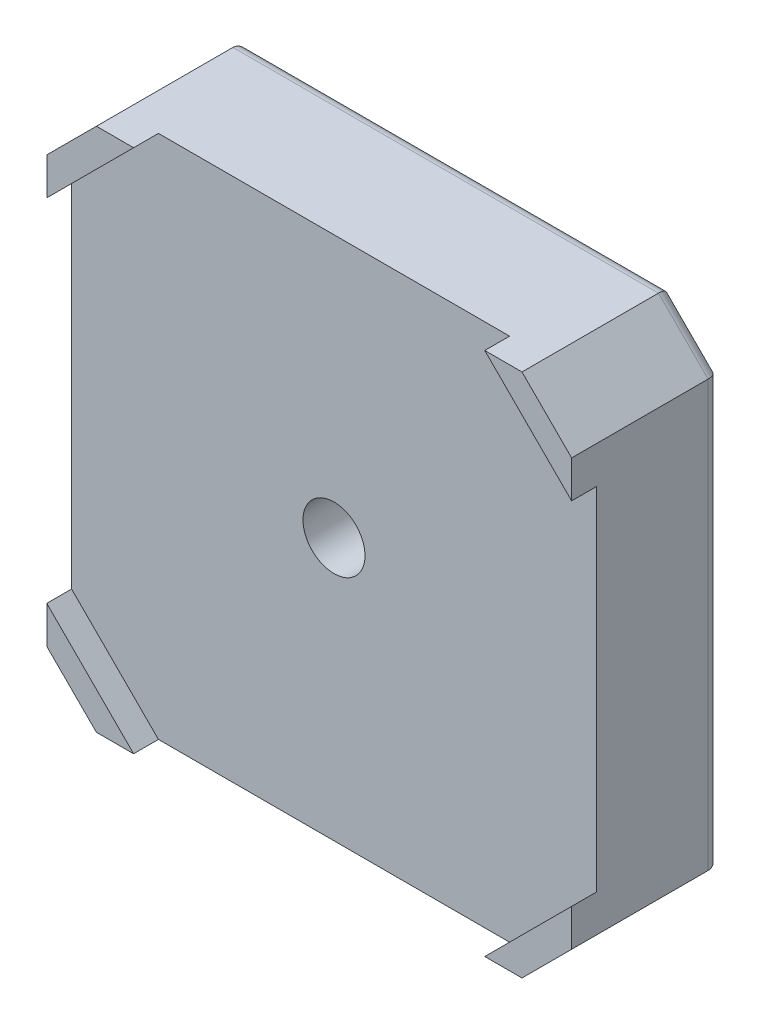
ISO-10303-21;
HEADER;
FILE_DESCRIPTION(('STEP AP214'),'2;1');
FILE_NAME('part.step','',(''),(''),'','','');
FILE_SCHEMA(('AUTOMOTIVE_DESIGN { 1 0 10303 214 1 1 1 1 }'));
ENDSEC;
DATA;
#1=APPLICATION_CONTEXT('core data for automotive mechanical design processes');
#2=APPLICATION_PROTOCOL_DEFINITION('international standard','automotive_design',2000,#1);
#3=PRODUCT_CONTEXT('',#1,'mechanical');
#4=PRODUCT('Part','Part','',(#3));
#5=PRODUCT_RELATED_PRODUCT_CATEGORY('part','',(#4));
#6=PRODUCT_DEFINITION_FORMATION('','',#4);
#7=PRODUCT_DEFINITION_CONTEXT('part definition',#1,'design');
#8=PRODUCT_DEFINITION('design','',#6,#7);
#9=PRODUCT_DEFINITION_SHAPE('','',#8);
#10=(LENGTH_UNIT() NAMED_UNIT(*) SI_UNIT(.MILLI.,.METRE.));
#11=(NAMED_UNIT(*) PLANE_ANGLE_UNIT() SI_UNIT($,.RADIAN.));
#12=(NAMED_UNIT(*) SI_UNIT($,.STERADIAN.) SOLID_ANGLE_UNIT());
#13=UNCERTAINTY_MEASURE_WITH_UNIT(LENGTH_MEASURE(1.E-05),#10,'distance_accuracy_value','');
#14=(GEOMETRIC_REPRESENTATION_CONTEXT(3) GLOBAL_UNCERTAINTY_ASSIGNED_CONTEXT((#13)) GLOBAL_UNIT_ASSIGNED_CONTEXT((#10,
#11,#12)) REPRESENTATION_CONTEXT('',''));
#15=CARTESIAN_POINT('',(0.,0.,0.));
#16=DIRECTION('',(0.,0.,1.));
#17=DIRECTION('',(1.,0.,0.));
#18=AXIS2_PLACEMENT_3D('',#15,#16,#17);
#19=CARTESIAN_POINT('',(0.,0.,24.));
#20=DIRECTION('',(0.,0.,-1.));
#21=DIRECTION('',(-1.,0.,0.));
#22=AXIS2_PLACEMENT_3D('',#19,#20,#21);
#23=PLANE('',#22);
#24=DIRECTION('',(0.,-1.,0.));
#25=VECTOR('',#24,1.);
#26=CARTESIAN_POINT('',(-42.3,-34.3,24.));
#27=LINE('',#26,#25);
#28=CARTESIAN_POINT('',(-42.3,34.3,24.));
#29=VERTEX_POINT('',#28);
#30=CARTESIAN_POINT('',(-42.3,28.3,24.));
#31=VERTEX_POINT('',#30);
#32=EDGE_CURVE('E208',#29,#31,#27,.T.);
#33=ORIENTED_EDGE('',*,*,#32,.T.);
#34=DIRECTION('',(-0.707106781186547,-0.707106781186547,0.));
#35=VECTOR('',#34,1.);
#36=CARTESIAN_POINT('',(-42.3,28.3,24.));
#37=LINE('',#36,#35);
#38=CARTESIAN_POINT('',(-28.3,42.3,24.));
#39=VERTEX_POINT('',#38);
#40=EDGE_CURVE('E194',#39,#31,#37,.T.);
#41=ORIENTED_EDGE('',*,*,#40,.F.);
#42=DIRECTION('',(-1.,0.,0.));
#43=VECTOR('',#42,1.);
#44=CARTESIAN_POINT('',(-34.3,42.3,24.));
#45=LINE('',#44,#43);
#46=CARTESIAN_POINT('',(-34.3,42.3,24.));
#47=VERTEX_POINT('',#46);
#48=EDGE_CURVE('E225',#39,#47,#45,.T.);
#49=ORIENTED_EDGE('',*,*,#48,.T.);
#50=DIRECTION('',(-0.707106781186548,-0.707106781186548,0.));
#51=VECTOR('',#50,1.);
#52=CARTESIAN_POINT('',(-42.3,34.3,24.));
#53=LINE('',#52,#51);
#54=EDGE_CURVE('E229',#47,#29,#53,.T.);
#55=ORIENTED_EDGE('',*,*,#54,.T.);
#56=EDGE_LOOP('',(#33,#41,#49,#55));
#57=FACE_BOUND('',#56,.T.);
#58=ADVANCED_FACE('F34',(#57),#23,.F.);
#59=CARTESIAN_POINT('',(34.3,42.3,24.));
#60=VERTEX_POINT('',#59);
#61=CARTESIAN_POINT('',(28.3,42.3,24.));
#62=VERTEX_POINT('',#61);
#63=EDGE_CURVE('E226',#60,#62,#45,.T.);
#64=ORIENTED_EDGE('',*,*,#63,.T.);
#65=DIRECTION('',(-0.707106781186547,0.707106781186548,0.));
#66=VECTOR('',#65,1.);
#67=CARTESIAN_POINT('',(28.3,42.3,24.));
#68=LINE('',#67,#66);
#69=CARTESIAN_POINT('',(42.3,28.3,24.));
#70=VERTEX_POINT('',#69);
#71=EDGE_CURVE('E426',#70,#62,#68,.T.);
#72=ORIENTED_EDGE('',*,*,#71,.F.);
#73=DIRECTION('',(0.,1.,0.));
#74=VECTOR('',#73,1.);
#75=CARTESIAN_POINT('',(42.3,-34.3,24.));
#76=LINE('',#75,#74);
#77=CARTESIAN_POINT('',(42.3,34.3,24.));
#78=VERTEX_POINT('',#77);
#79=EDGE_CURVE('E219',#70,#78,#76,.T.);
#80=ORIENTED_EDGE('',*,*,#79,.T.);
#81=DIRECTION('',(-0.707106781186548,0.707106781186548,0.));
#82=VECTOR('',#81,1.);
#83=CARTESIAN_POINT('',(34.3,42.3,24.));
#84=LINE('',#83,#82);
#85=EDGE_CURVE('E223',#78,#60,#84,.T.);
#86=ORIENTED_EDGE('',*,*,#85,.T.);
#87=EDGE_LOOP('',(#64,#72,#80,#86));
#88=FACE_BOUND('',#87,.T.);
#89=ADVANCED_FACE('F367',(#88),#23,.F.);
#90=CARTESIAN_POINT('',(42.3,-34.3,24.));
#91=VERTEX_POINT('',#90);
#92=CARTESIAN_POINT('',(42.3,-28.3,24.));
#93=VERTEX_POINT('',#92);
#94=EDGE_CURVE('E220',#91,#93,#76,.T.);
#95=ORIENTED_EDGE('',*,*,#94,.T.);
#96=DIRECTION('',(0.707106781186547,0.707106781186548,0.));
#97=VECTOR('',#96,1.);
#98=CARTESIAN_POINT('',(28.3,-42.3,24.));
#99=LINE('',#98,#97);
#100=CARTESIAN_POINT('',(28.3,-42.3,24.));
#101=VERTEX_POINT('',#100);
#102=EDGE_CURVE('E400',#101,#93,#99,.T.);
#103=ORIENTED_EDGE('',*,*,#102,.F.);
#104=DIRECTION('',(1.,0.,0.));
#105=VECTOR('',#104,1.);
#106=CARTESIAN_POINT('',(-34.3,-42.3,24.));
#107=LINE('',#106,#105);
#108=CARTESIAN_POINT('',(34.3,-42.3,24.));
#109=VERTEX_POINT('',#108);
#110=EDGE_CURVE('E213',#101,#109,#107,.T.);
#111=ORIENTED_EDGE('',*,*,#110,.T.);
#112=DIRECTION('',(0.707106781186547,0.707106781186548,0.));
#113=VECTOR('',#112,1.);
#114=CARTESIAN_POINT('',(34.3,-42.3,24.));
#115=LINE('',#114,#113);
#116=EDGE_CURVE('E217',#109,#91,#115,.T.);
#117=ORIENTED_EDGE('',*,*,#116,.T.);
#118=EDGE_LOOP('',(#95,#103,#111,#117));
#119=FACE_BOUND('',#118,.T.);
#120=ADVANCED_FACE('F374',(#119),#23,.F.);
#121=CARTESIAN_POINT('',(-42.3,-34.3,24.));
#122=DIRECTION('',(1.,0.,0.));
#123=DIRECTION('',(0.,0.,-1.));
#124=AXIS2_PLACEMENT_3D('',#121,#122,#123);
#125=PLANE('',#124);
#126=DIRECTION('',(0.,0.,-1.));
#127=VECTOR('',#126,1.);
#128=CARTESIAN_POINT('',(-42.3,34.3,24.));
#129=LINE('',#128,#127);
#130=CARTESIAN_POINT('',(-42.3,34.3,2.));
#131=VERTEX_POINT('',#130);
#132=EDGE_CURVE('E231',#29,#131,#129,.T.);
#133=ORIENTED_EDGE('',*,*,#132,.T.);
#134=DIRECTION('',(0.,-1.,0.));
#135=VECTOR('',#134,1.);
#136=CARTESIAN_POINT('',(-42.3,-34.3,2.));
#137=LINE('',#136,#135);
#138=CARTESIAN_POINT('',(-42.3,-34.3,2.));
#139=VERTEX_POINT('',#138);
#140=EDGE_CURVE('E277',#131,#139,#137,.T.);
#141=ORIENTED_EDGE('',*,*,#140,.T.);
#142=DIRECTION('',(0.,0.,-1.));
#143=VECTOR('',#142,1.);
#144=CARTESIAN_POINT('',(-42.3,-34.3,24.));
#145=LINE('',#144,#143);
#146=CARTESIAN_POINT('',(-42.3,-34.3,24.));
#147=VERTEX_POINT('',#146);
#148=EDGE_CURVE('E248',#147,#139,#145,.T.);
#149=ORIENTED_EDGE('',*,*,#148,.F.);
#150=CARTESIAN_POINT('',(-42.3,-28.3,24.));
#151=VERTEX_POINT('',#150);
#152=EDGE_CURVE('E200',#151,#147,#27,.T.);
#153=ORIENTED_EDGE('',*,*,#152,.F.);
#154=DIRECTION('',(0.,0.,1.));
#155=VECTOR('',#154,1.);
#156=CARTESIAN_POINT('',(-42.3,-28.3,20.));
#157=LINE('',#156,#155);
#158=CARTESIAN_POINT('',(-42.3,-28.3,20.));
#159=VERTEX_POINT('',#158);
#160=EDGE_CURVE('E177',#159,#151,#157,.T.);
#161=ORIENTED_EDGE('',*,*,#160,.F.);
#162=DIRECTION('',(0.,-1.,0.));
#163=VECTOR('',#162,1.);
#164=CARTESIAN_POINT('',(-42.3,-28.3,20.));
#165=LINE('',#164,#163);
#166=CARTESIAN_POINT('',(-42.3,28.3,20.));
#167=VERTEX_POINT('',#166);
#168=EDGE_CURVE('E185',#167,#159,#165,.T.);
#169=ORIENTED_EDGE('',*,*,#168,.F.);
#170=DIRECTION('',(0.,0.,1.));
#171=VECTOR('',#170,1.);
#172=CARTESIAN_POINT('',(-42.3,28.3,20.));
#173=LINE('',#172,#171);
#174=EDGE_CURVE('E423',#167,#31,#173,.T.);
#175=ORIENTED_EDGE('',*,*,#174,.T.);
#176=ORIENTED_EDGE('',*,*,#32,.F.);
#177=EDGE_LOOP('',(#133,#141,#149,#153,#161,#169,#175,#176));
#178=FACE_BOUND('',#177,.T.);
#179=ADVANCED_FACE('F198',(#178),#125,.F.);
#180=CARTESIAN_POINT('',(-42.3,-34.3,24.));
#181=DIRECTION('',(0.707106781186547,0.707106781186547,0.));
#182=DIRECTION('',(-0.707106781186548,0.707106781186548,0.));
#183=AXIS2_PLACEMENT_3D('',#180,#181,#182);
#184=PLANE('',#183);
#185=ORIENTED_EDGE('',*,*,#148,.T.);
#186=DIRECTION('',(0.707106781186548,-0.707106781186548,0.));
#187=VECTOR('',#186,1.);
#188=CARTESIAN_POINT('',(-34.3,-42.3,2.));
#189=LINE('',#188,#187);
#190=CARTESIAN_POINT('',(-34.3,-42.3,2.));
#191=VERTEX_POINT('',#190);
#192=EDGE_CURVE('E279',#139,#191,#189,.T.);
#193=ORIENTED_EDGE('',*,*,#192,.T.);
#194=DIRECTION('',(0.,0.,-1.));
#195=VECTOR('',#194,1.);
#196=CARTESIAN_POINT('',(-34.3,-42.3,24.));
#197=LINE('',#196,#195);
#198=CARTESIAN_POINT('',(-34.3,-42.3,24.));
#199=VERTEX_POINT('',#198);
#200=EDGE_CURVE('E245',#199,#191,#197,.T.);
#201=ORIENTED_EDGE('',*,*,#200,.F.);
#202=DIRECTION('',(0.707106781186548,-0.707106781186548,0.));
#203=VECTOR('',#202,1.);
#204=CARTESIAN_POINT('',(-42.3,-34.3,24.));
#205=LINE('',#204,#203);
#206=EDGE_CURVE('E211',#147,#199,#205,.T.);
#207=ORIENTED_EDGE('',*,*,#206,.F.);
#208=EDGE_LOOP('',(#185,#193,#201,#207));
#209=FACE_BOUND('',#208,.T.);
#210=ADVANCED_FACE('F396',(#209),#184,.F.);
#211=CARTESIAN_POINT('',(-34.3,-42.3,24.));
#212=DIRECTION('',(0.,1.,0.));
#213=DIRECTION('',(0.,0.,1.));
#214=AXIS2_PLACEMENT_3D('',#211,#212,#213);
#215=PLANE('',#214);
#216=ORIENTED_EDGE('',*,*,#200,.T.);
#217=DIRECTION('',(1.,0.,0.));
#218=VECTOR('',#217,1.);
#219=CARTESIAN_POINT('',(34.3,-42.3,2.));
#220=LINE('',#219,#218);
#221=CARTESIAN_POINT('',(34.3,-42.3,2.));
#222=VERTEX_POINT('',#221);
#223=EDGE_CURVE('E281',#191,#222,#220,.T.);
#224=ORIENTED_EDGE('',*,*,#223,.T.);
#225=DIRECTION('',(0.,0.,-1.));
#226=VECTOR('',#225,1.);
#227=CARTESIAN_POINT('',(34.3,-42.3,24.));
#228=LINE('',#227,#226);
#229=EDGE_CURVE('E242',#109,#222,#228,.T.);
#230=ORIENTED_EDGE('',*,*,#229,.F.);
#231=ORIENTED_EDGE('',*,*,#110,.F.);
#232=DIRECTION('',(0.,0.,1.));
#233=VECTOR('',#232,1.);
#234=CARTESIAN_POINT('',(28.3,-42.3,20.));
#235=LINE('',#234,#233);
#236=CARTESIAN_POINT('',(28.3,-42.3,20.));
#237=VERTEX_POINT('',#236);
#238=EDGE_CURVE('E202',#237,#101,#235,.T.);
#239=ORIENTED_EDGE('',*,*,#238,.F.);
#240=DIRECTION('',(1.,0.,0.));
#241=VECTOR('',#240,1.);
#242=CARTESIAN_POINT('',(-28.3,-42.3,20.));
#243=LINE('',#242,#241);
#244=CARTESIAN_POINT('',(-28.3,-42.3,20.));
#245=VERTEX_POINT('',#244);
#246=EDGE_CURVE('E184',#245,#237,#243,.T.);
#247=ORIENTED_EDGE('',*,*,#246,.F.);
#248=DIRECTION('',(0.,0.,1.));
#249=VECTOR('',#248,1.);
#250=CARTESIAN_POINT('',(-28.3,-42.3,20.));
#251=LINE('',#250,#249);
#252=CARTESIAN_POINT('',(-28.3,-42.3,24.));
#253=VERTEX_POINT('',#252);
#254=EDGE_CURVE('E180',#245,#253,#251,.T.);
#255=ORIENTED_EDGE('',*,*,#254,.T.);
#256=EDGE_CURVE('E214',#199,#253,#107,.T.);
#257=ORIENTED_EDGE('',*,*,#256,.F.);
#258=EDGE_LOOP('',(#216,#224,#230,#231,#239,#247,#255,#257));
#259=FACE_BOUND('',#258,.T.);
#260=ADVANCED_FACE('F783',(#259),#215,.F.);
#261=CARTESIAN_POINT('',(34.3,-42.3,24.));
#262=DIRECTION('',(-0.707106781186548,0.707106781186547,0.));
#263=DIRECTION('',(-0.707106781186547,-0.707106781186548,0.));
#264=AXIS2_PLACEMENT_3D('',#261,#262,#263);
#265=PLANE('',#264);
#266=ORIENTED_EDGE('',*,*,#229,.T.);
#267=DIRECTION('',(0.707106781186547,0.707106781186548,0.));
#268=VECTOR('',#267,1.);
#269=CARTESIAN_POINT('',(42.3,-34.3,2.));
#270=LINE('',#269,#268);
#271=CARTESIAN_POINT('',(42.3,-34.3,2.));
#272=VERTEX_POINT('',#271);
#273=EDGE_CURVE('E283',#222,#272,#270,.T.);
#274=ORIENTED_EDGE('',*,*,#273,.T.);
#275=DIRECTION('',(0.,0.,-1.));
#276=VECTOR('',#275,1.);
#277=CARTESIAN_POINT('',(42.3,-34.3,24.));
#278=LINE('',#277,#276);
#279=EDGE_CURVE('E240',#91,#272,#278,.T.);
#280=ORIENTED_EDGE('',*,*,#279,.F.);
#281=ORIENTED_EDGE('',*,*,#116,.F.);
#282=EDGE_LOOP('',(#266,#274,#280,#281));
#283=FACE_BOUND('',#282,.T.);
#284=ADVANCED_FACE('F775',(#283),#265,.F.);
#285=CARTESIAN_POINT('',(42.3,-34.3,24.));
#286=DIRECTION('',(-1.,0.,0.));
#287=DIRECTION('',(0.,0.,1.));
#288=AXIS2_PLACEMENT_3D('',#285,#286,#287);
#289=PLANE('',#288);
#290=ORIENTED_EDGE('',*,*,#279,.T.);
#291=DIRECTION('',(0.,1.,0.));
#292=VECTOR('',#291,1.);
#293=CARTESIAN_POINT('',(42.3,34.3,2.));
#294=LINE('',#293,#292);
#295=CARTESIAN_POINT('',(42.3,34.3,2.));
#296=VERTEX_POINT('',#295);
#297=EDGE_CURVE('E57',#272,#296,#294,.T.);
#298=ORIENTED_EDGE('',*,*,#297,.T.);
#299=DIRECTION('',(0.,0.,-1.));
#300=VECTOR('',#299,1.);
#301=CARTESIAN_POINT('',(42.3,34.3,24.));
#302=LINE('',#301,#300);
#303=EDGE_CURVE('E238',#78,#296,#302,.T.);
#304=ORIENTED_EDGE('',*,*,#303,.F.);
#305=ORIENTED_EDGE('',*,*,#79,.F.);
#306=DIRECTION('',(0.,0.,1.));
#307=VECTOR('',#306,1.);
#308=CARTESIAN_POINT('',(42.3,28.3,20.));
#309=LINE('',#308,#307);
#310=CARTESIAN_POINT('',(42.3,28.3,20.));
#311=VERTEX_POINT('',#310);
#312=EDGE_CURVE('E414',#311,#70,#309,.T.);
#313=ORIENTED_EDGE('',*,*,#312,.F.);
#314=DIRECTION('',(0.,1.,0.));
#315=VECTOR('',#314,1.);
#316=CARTESIAN_POINT('',(42.3,-28.3,20.));
#317=LINE('',#316,#315);
#318=CARTESIAN_POINT('',(42.3,-28.3,20.));
#319=VERTEX_POINT('',#318);
#320=EDGE_CURVE('E411',#319,#311,#317,.T.);
#321=ORIENTED_EDGE('',*,*,#320,.F.);
#322=DIRECTION('',(0.,0.,1.));
#323=VECTOR('',#322,1.);
#324=CARTESIAN_POINT('',(42.3,-28.3,20.));
#325=LINE('',#324,#323);
#326=EDGE_CURVE('E408',#319,#93,#325,.T.);
#327=ORIENTED_EDGE('',*,*,#326,.T.);
#328=ORIENTED_EDGE('',*,*,#94,.F.);
#329=EDGE_LOOP('',(#290,#298,#304,#305,#313,#321,#327,#328));
#330=FACE_BOUND('',#329,.T.);
#331=ADVANCED_FACE('F405',(#330),#289,.F.);
#332=CARTESIAN_POINT('',(34.3,42.3,24.));
#333=DIRECTION('',(-0.707106781186547,-0.707106781186547,0.));
#334=DIRECTION('',(0.707106781186548,-0.707106781186548,0.));
#335=AXIS2_PLACEMENT_3D('',#332,#333,#334);
#336=PLANE('',#335);
#337=ORIENTED_EDGE('',*,*,#303,.T.);
#338=DIRECTION('',(-0.707106781186548,0.707106781186548,0.));
#339=VECTOR('',#338,1.);
#340=CARTESIAN_POINT('',(34.3,42.3,2.));
#341=LINE('',#340,#339);
#342=CARTESIAN_POINT('',(34.3,42.3,2.));
#343=VERTEX_POINT('',#342);
#344=EDGE_CURVE('E49',#296,#343,#341,.T.);
#345=ORIENTED_EDGE('',*,*,#344,.T.);
#346=DIRECTION('',(0.,0.,-1.));
#347=VECTOR('',#346,1.);
#348=CARTESIAN_POINT('',(34.3,42.3,24.));
#349=LINE('',#348,#347);
#350=EDGE_CURVE('E236',#60,#343,#349,.T.);
#351=ORIENTED_EDGE('',*,*,#350,.F.);
#352=ORIENTED_EDGE('',*,*,#85,.F.);
#353=EDGE_LOOP('',(#337,#345,#351,#352));
#354=FACE_BOUND('',#353,.T.);
#355=ADVANCED_FACE('F759',(#354),#336,.F.);
#356=CARTESIAN_POINT('',(-34.3,42.3,24.));
#357=DIRECTION('',(0.,-1.,0.));
#358=DIRECTION('',(0.,0.,-1.));
#359=AXIS2_PLACEMENT_3D('',#356,#357,#358);
#360=PLANE('',#359);
#361=ORIENTED_EDGE('',*,*,#350,.T.);
#362=DIRECTION('',(-1.,0.,0.));
#363=VECTOR('',#362,1.);
#364=CARTESIAN_POINT('',(-34.3,42.3,2.));
#365=LINE('',#364,#363);
#366=CARTESIAN_POINT('',(-34.3,42.3,2.));
#367=VERTEX_POINT('',#366);
#368=EDGE_CURVE('E287',#343,#367,#365,.T.);
#369=ORIENTED_EDGE('',*,*,#368,.T.);
#370=DIRECTION('',(0.,0.,-1.));
#371=VECTOR('',#370,1.);
#372=CARTESIAN_POINT('',(-34.3,42.3,24.));
#373=LINE('',#372,#371);
#374=EDGE_CURVE('E233',#47,#367,#373,.T.);
#375=ORIENTED_EDGE('',*,*,#374,.F.);
#376=ORIENTED_EDGE('',*,*,#48,.F.);
#377=DIRECTION('',(0.,0.,1.));
#378=VECTOR('',#377,1.);
#379=CARTESIAN_POINT('',(-28.3,42.3,20.));
#380=LINE('',#379,#378);
#381=CARTESIAN_POINT('',(-28.3,42.3,20.));
#382=VERTEX_POINT('',#381);
#383=EDGE_CURVE('E421',#382,#39,#380,.T.);
#384=ORIENTED_EDGE('',*,*,#383,.F.);
#385=DIRECTION('',(-1.,0.,0.));
#386=VECTOR('',#385,1.);
#387=CARTESIAN_POINT('',(-28.3,42.3,20.));
#388=LINE('',#387,#386);
#389=CARTESIAN_POINT('',(28.3,42.3,20.));
#390=VERTEX_POINT('',#389);
#391=EDGE_CURVE('E204',#390,#382,#388,.T.);
#392=ORIENTED_EDGE('',*,*,#391,.F.);
#393=DIRECTION('',(0.,0.,1.));
#394=VECTOR('',#393,1.);
#395=CARTESIAN_POINT('',(28.3,42.3,20.));
#396=LINE('',#395,#394);
#397=EDGE_CURVE('E416',#390,#62,#396,.T.);
#398=ORIENTED_EDGE('',*,*,#397,.T.);
#399=ORIENTED_EDGE('',*,*,#63,.F.);
#400=EDGE_LOOP('',(#361,#369,#375,#376,#384,#392,#398,#399));
#401=FACE_BOUND('',#400,.T.);
#402=ADVANCED_FACE('F388',(#401),#360,.F.);
#403=CARTESIAN_POINT('',(-42.3,34.3,24.));
#404=DIRECTION('',(0.707106781186547,-0.707106781186547,0.));
#405=DIRECTION('',(0.707106781186548,0.707106781186548,0.));
#406=AXIS2_PLACEMENT_3D('',#403,#404,#405);
#407=PLANE('',#406);
#408=ORIENTED_EDGE('',*,*,#374,.T.);
#409=DIRECTION('',(-0.707106781186548,-0.707106781186548,0.));
#410=VECTOR('',#409,1.);
#411=CARTESIAN_POINT('',(-42.3,34.3,2.));
#412=LINE('',#411,#410);
#413=EDGE_CURVE('E257',#367,#131,#412,.T.);
#414=ORIENTED_EDGE('',*,*,#413,.T.);
#415=ORIENTED_EDGE('',*,*,#132,.F.);
#416=ORIENTED_EDGE('',*,*,#54,.F.);
#417=EDGE_LOOP('',(#408,#414,#415,#416));
#418=FACE_BOUND('',#417,.T.);
#419=ADVANCED_FACE('F380',(#418),#407,.F.);
#420=ORIENTED_EDGE('',*,*,#256,.T.);
#421=DIRECTION('',(0.707106781186547,-0.707106781186547,0.));
#422=VECTOR('',#421,1.);
#423=CARTESIAN_POINT('',(-42.3,-28.3,24.));
#424=LINE('',#423,#422);
#425=EDGE_CURVE('E255',#151,#253,#424,.T.);
#426=ORIENTED_EDGE('',*,*,#425,.F.);
#427=ORIENTED_EDGE('',*,*,#152,.T.);
#428=ORIENTED_EDGE('',*,*,#206,.T.);
#429=EDGE_LOOP('',(#420,#426,#427,#428));
#430=FACE_BOUND('',#429,.T.);
#431=ADVANCED_FACE('F370',(#430),#23,.F.);
#432=CARTESIAN_POINT('',(0.,0.,0.));
#433=DIRECTION('',(0.,0.,-1.));
#434=DIRECTION('',(-1.,0.,0.));
#435=AXIS2_PLACEMENT_3D('',#432,#433,#434);
#436=PLANE('',#435);
#437=CARTESIAN_POINT('',(31.,-31.,0.));
#438=DIRECTION('',(0.,0.,-1.));
#439=DIRECTION('',(-1.,0.,0.));
#440=AXIS2_PLACEMENT_3D('',#437,#438,#439);
#441=CIRCLE('',#440,4.);
#442=CARTESIAN_POINT('',(27.,-31.,0.));
#443=VERTEX_POINT('',#442);
#444=EDGE_CURVE('E342',#443,#443,#441,.F.);
#445=ORIENTED_EDGE('',*,*,#444,.T.);
#446=EDGE_LOOP('',(#445));
#447=FACE_BOUND('',#446,.T.);
#448=CARTESIAN_POINT('',(-31.,-31.,0.));
#449=DIRECTION('',(0.,0.,-1.));
#450=DIRECTION('',(-1.,0.,0.));
#451=AXIS2_PLACEMENT_3D('',#448,#449,#450);
#452=CIRCLE('',#451,4.);
#453=CARTESIAN_POINT('',(-35.,-31.,0.));
#454=VERTEX_POINT('',#453);
#455=EDGE_CURVE('E339',#454,#454,#452,.F.);
#456=ORIENTED_EDGE('',*,*,#455,.T.);
#457=EDGE_LOOP('',(#456));
#458=FACE_BOUND('',#457,.T.);
#459=CARTESIAN_POINT('',(-31.,31.,0.));
#460=DIRECTION('',(0.,0.,-1.));
#461=DIRECTION('',(-1.,0.,0.));
#462=AXIS2_PLACEMENT_3D('',#459,#460,#461);
#463=CIRCLE('',#462,4.);
#464=CARTESIAN_POINT('',(-35.,31.,0.));
#465=VERTEX_POINT('',#464);
#466=EDGE_CURVE('E336',#465,#465,#463,.F.);
#467=ORIENTED_EDGE('',*,*,#466,.T.);
#468=EDGE_LOOP('',(#467));
#469=FACE_BOUND('',#468,.T.);
#470=CARTESIAN_POINT('',(31.,31.,0.));
#471=DIRECTION('',(0.,0.,-1.));
#472=DIRECTION('',(-1.,0.,0.));
#473=AXIS2_PLACEMENT_3D('',#470,#471,#472);
#474=CIRCLE('',#473,4.);
#475=CARTESIAN_POINT('',(27.,31.,0.));
#476=VERTEX_POINT('',#475);
#477=EDGE_CURVE('E333',#476,#476,#474,.F.);
#478=ORIENTED_EDGE('',*,*,#477,.T.);
#479=EDGE_LOOP('',(#478));
#480=FACE_BOUND('',#479,.T.);
#481=DIRECTION('',(0.,-1.,0.));
#482=VECTOR('',#481,1.);
#483=CARTESIAN_POINT('',(-40.3,34.3,0.));
#484=LINE('',#483,#482);
#485=CARTESIAN_POINT('',(-40.3,-33.4715728752538,0.));
#486=VERTEX_POINT('',#485);
#487=CARTESIAN_POINT('',(-40.3,33.4715728752538,0.));
#488=VERTEX_POINT('',#487);
#489=EDGE_CURVE('E272',#486,#488,#484,.F.);
#490=ORIENTED_EDGE('',*,*,#489,.T.);
#491=DIRECTION('',(-0.707106781186548,-0.707106781186548,0.));
#492=VECTOR('',#491,1.);
#493=CARTESIAN_POINT('',(-32.8857864376269,40.8857864376269,0.));
#494=LINE('',#493,#492);
#495=CARTESIAN_POINT('',(-33.4715728752538,40.3,0.));
#496=VERTEX_POINT('',#495);
#497=EDGE_CURVE('E274',#488,#496,#494,.F.);
#498=ORIENTED_EDGE('',*,*,#497,.T.);
#499=DIRECTION('',(-1.,0.,0.));
#500=VECTOR('',#499,1.);
#501=CARTESIAN_POINT('',(34.3,40.3,0.));
#502=LINE('',#501,#500);
#503=CARTESIAN_POINT('',(33.4715728752538,40.3,0.));
#504=VERTEX_POINT('',#503);
#505=EDGE_CURVE('E260',#496,#504,#502,.F.);
#506=ORIENTED_EDGE('',*,*,#505,.T.);
#507=DIRECTION('',(-0.707106781186548,0.707106781186548,0.));
#508=VECTOR('',#507,1.);
#509=CARTESIAN_POINT('',(40.8857864376269,32.8857864376269,0.));
#510=LINE('',#509,#508);
#511=CARTESIAN_POINT('',(40.3,33.4715728752538,0.));
#512=VERTEX_POINT('',#511);
#513=EDGE_CURVE('E262',#504,#512,#510,.F.);
#514=ORIENTED_EDGE('',*,*,#513,.T.);
#515=DIRECTION('',(0.,1.,0.));
#516=VECTOR('',#515,1.);
#517=CARTESIAN_POINT('',(40.3,-34.3,0.));
#518=LINE('',#517,#516);
#519=CARTESIAN_POINT('',(40.3,-33.4715728752538,0.));
#520=VERTEX_POINT('',#519);
#521=EDGE_CURVE('E264',#512,#520,#518,.F.);
#522=ORIENTED_EDGE('',*,*,#521,.T.);
#523=DIRECTION('',(0.707106781186547,0.707106781186548,0.));
#524=VECTOR('',#523,1.);
#525=CARTESIAN_POINT('',(32.8857864376269,-40.8857864376269,0.));
#526=LINE('',#525,#524);
#527=CARTESIAN_POINT('',(33.4715728752538,-40.3,0.));
#528=VERTEX_POINT('',#527);
#529=EDGE_CURVE('E266',#520,#528,#526,.F.);
#530=ORIENTED_EDGE('',*,*,#529,.T.);
#531=DIRECTION('',(1.,0.,0.));
#532=VECTOR('',#531,1.);
#533=CARTESIAN_POINT('',(-34.3,-40.3,0.));
#534=LINE('',#533,#532);
#535=CARTESIAN_POINT('',(-33.4715728752538,-40.3,0.));
#536=VERTEX_POINT('',#535);
#537=EDGE_CURVE('E268',#528,#536,#534,.F.);
#538=ORIENTED_EDGE('',*,*,#537,.T.);
#539=DIRECTION('',(0.707106781186548,-0.707106781186548,0.));
#540=VECTOR('',#539,1.);
#541=CARTESIAN_POINT('',(-40.8857864376269,-32.8857864376269,0.));
#542=LINE('',#541,#540);
#543=EDGE_CURVE('E270',#536,#486,#542,.F.);
#544=ORIENTED_EDGE('',*,*,#543,.T.);
#545=EDGE_LOOP('',(#490,#498,#506,#514,#522,#530,#538,#544));
#546=FACE_BOUND('',#545,.T.);
#547=CARTESIAN_POINT('',(0.,0.,0.));
#548=DIRECTION('',(0.,0.,-1.));
#549=DIRECTION('',(-1.,0.,0.));
#550=AXIS2_PLACEMENT_3D('',#547,#548,#549);
#551=CIRCLE('',#550,22.);
#552=CARTESIAN_POINT('',(-22.,0.,0.));
#553=VERTEX_POINT('',#552);
#554=EDGE_CURVE('E251',#553,#553,#551,.T.);
#555=ORIENTED_EDGE('',*,*,#554,.F.);
#556=EDGE_LOOP('',(#555));
#557=FACE_BOUND('',#556,.T.);
#558=ADVANCED_FACE('F379',(#447,#458,#469,#480,#546,#557),#436,.T.);
#559=CARTESIAN_POINT('',(-42.3,28.3,20.));
#560=DIRECTION('',(-0.707106781186547,0.707106781186547,0.));
#561=DIRECTION('',(-0.707106781186548,-0.707106781186548,0.));
#562=AXIS2_PLACEMENT_3D('',#559,#560,#561);
#563=PLANE('',#562);
#564=ORIENTED_EDGE('',*,*,#40,.T.);
#565=ORIENTED_EDGE('',*,*,#174,.F.);
#566=DIRECTION('',(-0.707106781186547,-0.707106781186547,0.));
#567=VECTOR('',#566,1.);
#568=CARTESIAN_POINT('',(-42.3,28.3,20.));
#569=LINE('',#568,#567);
#570=EDGE_CURVE('E191',#382,#167,#569,.T.);
#571=ORIENTED_EDGE('',*,*,#570,.F.);
#572=ORIENTED_EDGE('',*,*,#383,.T.);
#573=EDGE_LOOP('',(#564,#565,#571,#572));
#574=FACE_BOUND('',#573,.T.);
#575=ADVANCED_FACE('F386',(#574),#563,.F.);
#576=CARTESIAN_POINT('',(28.3,42.3,20.));
#577=DIRECTION('',(0.707106781186548,0.707106781186547,0.));
#578=DIRECTION('',(-0.707106781186547,0.707106781186548,0.));
#579=AXIS2_PLACEMENT_3D('',#576,#577,#578);
#580=PLANE('',#579);
#581=ORIENTED_EDGE('',*,*,#71,.T.);
#582=ORIENTED_EDGE('',*,*,#397,.F.);
#583=DIRECTION('',(-0.707106781186547,0.707106781186548,0.));
#584=VECTOR('',#583,1.);
#585=CARTESIAN_POINT('',(28.3,42.3,20.));
#586=LINE('',#585,#584);
#587=EDGE_CURVE('E431',#311,#390,#586,.T.);
#588=ORIENTED_EDGE('',*,*,#587,.F.);
#589=ORIENTED_EDGE('',*,*,#312,.T.);
#590=EDGE_LOOP('',(#581,#582,#588,#589));
#591=FACE_BOUND('',#590,.T.);
#592=ADVANCED_FACE('F513',(#591),#580,.F.);
#593=CARTESIAN_POINT('',(28.3,-42.3,20.));
#594=DIRECTION('',(0.707106781186548,-0.707106781186547,0.));
#595=DIRECTION('',(0.707106781186547,0.707106781186548,0.));
#596=AXIS2_PLACEMENT_3D('',#593,#594,#595);
#597=PLANE('',#596);
#598=ORIENTED_EDGE('',*,*,#102,.T.);
#599=ORIENTED_EDGE('',*,*,#326,.F.);
#600=DIRECTION('',(0.707106781186547,0.707106781186548,0.));
#601=VECTOR('',#600,1.);
#602=CARTESIAN_POINT('',(28.3,-42.3,20.));
#603=LINE('',#602,#601);
#604=EDGE_CURVE('E435',#237,#319,#603,.T.);
#605=ORIENTED_EDGE('',*,*,#604,.F.);
#606=ORIENTED_EDGE('',*,*,#238,.T.);
#607=EDGE_LOOP('',(#598,#599,#605,#606));
#608=FACE_BOUND('',#607,.T.);
#609=ADVANCED_FACE('F517',(#608),#597,.F.);
#610=CARTESIAN_POINT('',(-42.3,-28.3,20.));
#611=DIRECTION('',(-0.707106781186547,-0.707106781186547,0.));
#612=DIRECTION('',(0.707106781186548,-0.707106781186548,0.));
#613=AXIS2_PLACEMENT_3D('',#610,#611,#612);
#614=PLANE('',#613);
#615=ORIENTED_EDGE('',*,*,#425,.T.);
#616=ORIENTED_EDGE('',*,*,#254,.F.);
#617=DIRECTION('',(0.707106781186547,-0.707106781186547,0.));
#618=VECTOR('',#617,1.);
#619=CARTESIAN_POINT('',(-42.3,-28.3,20.));
#620=LINE('',#619,#618);
#621=EDGE_CURVE('E173',#159,#245,#620,.T.);
#622=ORIENTED_EDGE('',*,*,#621,.F.);
#623=ORIENTED_EDGE('',*,*,#160,.T.);
#624=EDGE_LOOP('',(#615,#616,#622,#623));
#625=FACE_BOUND('',#624,.T.);
#626=ADVANCED_FACE('F175',(#625),#614,.F.);
#627=CARTESIAN_POINT('',(0.,0.,20.));
#628=DIRECTION('',(0.,0.,-1.));
#629=DIRECTION('',(-1.,0.,0.));
#630=AXIS2_PLACEMENT_3D('',#627,#628,#629);
#631=PLANE('',#630);
#632=CARTESIAN_POINT('',(0.,0.,20.));
#633=DIRECTION('',(0.,0.,-1.));
#634=DIRECTION('',(-1.,0.,0.));
#635=AXIS2_PLACEMENT_3D('',#632,#633,#634);
#636=CIRCLE('',#635,5.);
#637=CARTESIAN_POINT('',(-5.,0.,20.));
#638=VERTEX_POINT('',#637);
#639=EDGE_CURVE('E252',#638,#638,#636,.T.);
#640=ORIENTED_EDGE('',*,*,#639,.T.);
#641=EDGE_LOOP('',(#640));
#642=FACE_BOUND('',#641,.T.);
#643=ORIENTED_EDGE('',*,*,#168,.T.);
#644=ORIENTED_EDGE('',*,*,#621,.T.);
#645=ORIENTED_EDGE('',*,*,#246,.T.);
#646=ORIENTED_EDGE('',*,*,#604,.T.);
#647=ORIENTED_EDGE('',*,*,#320,.T.);
#648=ORIENTED_EDGE('',*,*,#587,.T.);
#649=ORIENTED_EDGE('',*,*,#391,.T.);
#650=ORIENTED_EDGE('',*,*,#570,.T.);
#651=EDGE_LOOP('',(#643,#644,#645,#646,#647,#648,#649,#650));
#652=FACE_BOUND('',#651,.T.);
#653=ADVANCED_FACE('F189',(#642,#652),#631,.F.);
#654=CARTESIAN_POINT('',(0.,0.,-4.));
#655=DIRECTION('',(0.,0.,1.));
#656=DIRECTION('',(1.,0.,0.));
#657=AXIS2_PLACEMENT_3D('',#654,#655,#656);
#658=CYLINDRICAL_SURFACE('',#657,22.);
#659=CARTESIAN_POINT('',(0.,0.,-3.));
#660=DIRECTION('',(0.,0.,-1.));
#661=DIRECTION('',(-1.,0.,0.));
#662=AXIS2_PLACEMENT_3D('',#659,#660,#661);
#663=CIRCLE('',#662,22.);
#664=CARTESIAN_POINT('',(-22.,0.,-3.));
#665=VERTEX_POINT('',#664);
#666=EDGE_CURVE('E327',#665,#665,#663,.F.);
#667=ORIENTED_EDGE('',*,*,#666,.T.);
#668=EDGE_LOOP('',(#667));
#669=FACE_BOUND('',#668,.T.);
#670=ORIENTED_EDGE('',*,*,#554,.T.);
#671=EDGE_LOOP('',(#670));
#672=FACE_BOUND('',#671,.T.);
#673=ADVANCED_FACE('F503',(#669,#672),#658,.T.);
#674=CARTESIAN_POINT('',(0.,0.,-4.));
#675=DIRECTION('',(0.,0.,-1.));
#676=DIRECTION('',(-1.,0.,0.));
#677=AXIS2_PLACEMENT_3D('',#674,#675,#676);
#678=PLANE('',#677);
#679=CARTESIAN_POINT('',(0.,0.,-4.));
#680=DIRECTION('',(0.,0.,-1.));
#681=DIRECTION('',(-1.,0.,0.));
#682=AXIS2_PLACEMENT_3D('',#679,#680,#681);
#683=CIRCLE('',#682,12.);
#684=CARTESIAN_POINT('',(-12.,0.,-4.));
#685=VERTEX_POINT('',#684);
#686=EDGE_CURVE('E321',#685,#685,#683,.F.);
#687=ORIENTED_EDGE('',*,*,#686,.T.);
#688=EDGE_LOOP('',(#687));
#689=FACE_BOUND('',#688,.T.);
#690=CARTESIAN_POINT('',(0.,0.,-4.));
#691=DIRECTION('',(0.,0.,-1.));
#692=DIRECTION('',(-1.,0.,0.));
#693=AXIS2_PLACEMENT_3D('',#690,#691,#692);
#694=CIRCLE('',#693,21.);
#695=CARTESIAN_POINT('',(-21.,0.,-4.));
#696=VERTEX_POINT('',#695);
#697=EDGE_CURVE('E318',#696,#696,#694,.T.);
#698=ORIENTED_EDGE('',*,*,#697,.T.);
#699=EDGE_LOOP('',(#698));
#700=FACE_BOUND('',#699,.T.);
#701=ADVANCED_FACE('F499',(#689,#700),#678,.T.);
#702=CARTESIAN_POINT('',(0.,0.,10.));
#703=DIRECTION('',(0.,0.,-1.));
#704=DIRECTION('',(-1.,0.,0.));
#705=AXIS2_PLACEMENT_3D('',#702,#703,#704);
#706=CYLINDRICAL_SURFACE('',#705,11.);
#707=CARTESIAN_POINT('',(0.,0.,-3.));
#708=DIRECTION('',(0.,0.,-1.));
#709=DIRECTION('',(-1.,0.,0.));
#710=AXIS2_PLACEMENT_3D('',#707,#708,#709);
#711=CIRCLE('',#710,11.);
#712=CARTESIAN_POINT('',(-11.,0.,-3.));
#713=VERTEX_POINT('',#712);
#714=EDGE_CURVE('E315',#713,#713,#711,.T.);
#715=ORIENTED_EDGE('',*,*,#714,.T.);
#716=EDGE_LOOP('',(#715));
#717=FACE_BOUND('',#716,.T.);
#718=CARTESIAN_POINT('',(0.,0.,9.));
#719=DIRECTION('',(0.,0.,-1.));
#720=DIRECTION('',(-1.,0.,0.));
#721=AXIS2_PLACEMENT_3D('',#718,#719,#720);
#722=CIRCLE('',#721,11.);
#723=CARTESIAN_POINT('',(-11.,0.,9.));
#724=VERTEX_POINT('',#723);
#725=EDGE_CURVE('E289',#724,#724,#722,.F.);
#726=ORIENTED_EDGE('',*,*,#725,.T.);
#727=EDGE_LOOP('',(#726));
#728=FACE_BOUND('',#727,.T.);
#729=ADVANCED_FACE('F495',(#717,#728),#706,.F.);
#730=CARTESIAN_POINT('',(0.,0.,10.));
#731=DIRECTION('',(0.,0.,-1.));
#732=DIRECTION('',(-1.,0.,0.));
#733=AXIS2_PLACEMENT_3D('',#730,#731,#732);
#734=PLANE('',#733);
#735=CARTESIAN_POINT('',(0.,0.,10.));
#736=DIRECTION('',(0.,0.,-1.));
#737=DIRECTION('',(-1.,0.,0.));
#738=AXIS2_PLACEMENT_3D('',#735,#736,#737);
#739=CIRCLE('',#738,10.);
#740=CARTESIAN_POINT('',(-10.,0.,10.));
#741=VERTEX_POINT('',#740);
#742=EDGE_CURVE('E324',#741,#741,#739,.T.);
#743=ORIENTED_EDGE('',*,*,#742,.T.);
#744=EDGE_LOOP('',(#743));
#745=FACE_BOUND('',#744,.T.);
#746=CARTESIAN_POINT('',(0.,0.,10.));
#747=DIRECTION('',(0.,0.,-1.));
#748=DIRECTION('',(-1.,0.,0.));
#749=AXIS2_PLACEMENT_3D('',#746,#747,#748);
#750=CIRCLE('',#749,5.);
#751=CARTESIAN_POINT('',(-5.,0.,10.));
#752=VERTEX_POINT('',#751);
#753=EDGE_CURVE('E256',#752,#752,#750,.T.);
#754=ORIENTED_EDGE('',*,*,#753,.F.);
#755=EDGE_LOOP('',(#754));
#756=FACE_BOUND('',#755,.T.);
#757=ADVANCED_FACE('F491',(#745,#756),#734,.T.);
#758=CARTESIAN_POINT('',(0.,0.,24.));
#759=DIRECTION('',(0.,0.,-1.));
#760=DIRECTION('',(-1.,0.,0.));
#761=AXIS2_PLACEMENT_3D('',#758,#759,#760);
#762=CYLINDRICAL_SURFACE('',#761,5.);
#763=ORIENTED_EDGE('',*,*,#753,.T.);
#764=EDGE_LOOP('',(#763));
#765=FACE_BOUND('',#764,.T.);
#766=ORIENTED_EDGE('',*,*,#639,.F.);
#767=EDGE_LOOP('',(#766));
#768=FACE_BOUND('',#767,.T.);
#769=ADVANCED_FACE('F487',(#765,#768),#762,.F.);
#770=CARTESIAN_POINT('',(32.8857864376269,-40.8857864376269,2.));
#771=DIRECTION('',(-0.707106781186547,-0.707106781186548,0.));
#772=DIRECTION('',(0.707106781186548,-0.707106781186547,0.));
#773=AXIS2_PLACEMENT_3D('',#770,#771,#772);
#774=CYLINDRICAL_SURFACE('',#773,2.);
#775=CARTESIAN_POINT('',(33.4715728752538,-40.3,2.));
#776=DIRECTION('',(-0.923879532511287,-0.38268343236509,0.));
#777=DIRECTION('',(0.38268343236509,-0.923879532511287,0.));
#778=AXIS2_PLACEMENT_3D('',#775,#776,#777);
#779=ELLIPSE('',#778,2.16478440058479,2.);
#780=EDGE_CURVE('E307',#528,#222,#779,.T.);
#781=ORIENTED_EDGE('',*,*,#780,.F.);
#782=ORIENTED_EDGE('',*,*,#529,.F.);
#783=CARTESIAN_POINT('',(40.3,-33.4715728752538,2.));
#784=DIRECTION('',(-0.38268343236509,-0.923879532511287,0.));
#785=DIRECTION('',(0.923879532511287,-0.38268343236509,0.));
#786=AXIS2_PLACEMENT_3D('',#783,#784,#785);
#787=ELLIPSE('',#786,2.16478440058479,2.);
#788=EDGE_CURVE('E310',#272,#520,#787,.F.);
#789=ORIENTED_EDGE('',*,*,#788,.F.);
#790=ORIENTED_EDGE('',*,*,#273,.F.);
#791=EDGE_LOOP('',(#781,#782,#789,#790));
#792=FACE_BOUND('',#791,.T.);
#793=ADVANCED_FACE('F490',(#792),#774,.T.);
#794=CARTESIAN_POINT('',(40.3,-34.3,2.));
#795=DIRECTION('',(0.,-1.,0.));
#796=DIRECTION('',(0.,0.,-1.));
#797=AXIS2_PLACEMENT_3D('',#794,#795,#796);
#798=CYLINDRICAL_SURFACE('',#797,2.);
#799=ORIENTED_EDGE('',*,*,#788,.T.);
#800=ORIENTED_EDGE('',*,*,#521,.F.);
#801=CARTESIAN_POINT('',(40.3,33.4715728752538,2.));
#802=DIRECTION('',(0.38268343236509,-0.923879532511287,0.));
#803=DIRECTION('',(0.923879532511287,0.38268343236509,0.));
#804=AXIS2_PLACEMENT_3D('',#801,#802,#803);
#805=ELLIPSE('',#804,2.16478440058479,2.);
#806=EDGE_CURVE('E304',#296,#512,#805,.F.);
#807=ORIENTED_EDGE('',*,*,#806,.F.);
#808=ORIENTED_EDGE('',*,*,#297,.F.);
#809=EDGE_LOOP('',(#799,#800,#807,#808));
#810=FACE_BOUND('',#809,.T.);
#811=ADVANCED_FACE('F558',(#810),#798,.T.);
#812=CARTESIAN_POINT('',(-34.3,-40.3,2.));
#813=DIRECTION('',(-1.,0.,0.));
#814=DIRECTION('',(0.,0.,1.));
#815=AXIS2_PLACEMENT_3D('',#812,#813,#814);
#816=CYLINDRICAL_SURFACE('',#815,2.);
#817=ORIENTED_EDGE('',*,*,#780,.T.);
#818=ORIENTED_EDGE('',*,*,#223,.F.);
#819=CARTESIAN_POINT('',(-33.4715728752538,-40.3,2.));
#820=DIRECTION('',(-0.923879532511287,0.38268343236509,0.));
#821=DIRECTION('',(-0.38268343236509,-0.923879532511287,0.));
#822=AXIS2_PLACEMENT_3D('',#819,#820,#821);
#823=ELLIPSE('',#822,2.16478440058479,2.);
#824=EDGE_CURVE('E301',#536,#191,#823,.T.);
#825=ORIENTED_EDGE('',*,*,#824,.F.);
#826=ORIENTED_EDGE('',*,*,#537,.F.);
#827=EDGE_LOOP('',(#817,#818,#825,#826));
#828=FACE_BOUND('',#827,.T.);
#829=ADVANCED_FACE('F567',(#828),#816,.T.);
#830=CARTESIAN_POINT('',(32.8857864376269,40.8857864376269,2.));
#831=DIRECTION('',(0.707106781186548,-0.707106781186548,0.));
#832=DIRECTION('',(0.707106781186548,0.707106781186548,0.));
#833=AXIS2_PLACEMENT_3D('',#830,#831,#832);
#834=CYLINDRICAL_SURFACE('',#833,2.);
#835=ORIENTED_EDGE('',*,*,#806,.T.);
#836=ORIENTED_EDGE('',*,*,#513,.F.);
#837=CARTESIAN_POINT('',(33.4715728752538,40.3,2.));
#838=DIRECTION('',(0.923879532511287,-0.38268343236509,0.));
#839=DIRECTION('',(0.38268343236509,0.923879532511287,0.));
#840=AXIS2_PLACEMENT_3D('',#837,#838,#839);
#841=ELLIPSE('',#840,2.16478440058479,2.);
#842=EDGE_CURVE('E298',#343,#504,#841,.F.);
#843=ORIENTED_EDGE('',*,*,#842,.F.);
#844=ORIENTED_EDGE('',*,*,#344,.F.);
#845=EDGE_LOOP('',(#835,#836,#843,#844));
#846=FACE_BOUND('',#845,.T.);
#847=ADVANCED_FACE('F575',(#846),#834,.T.);
#848=CARTESIAN_POINT('',(-40.8857864376269,-32.8857864376269,2.));
#849=DIRECTION('',(-0.707106781186548,0.707106781186548,0.));
#850=DIRECTION('',(-0.707106781186548,-0.707106781186548,0.));
#851=AXIS2_PLACEMENT_3D('',#848,#849,#850);
#852=CYLINDRICAL_SURFACE('',#851,2.);
#853=ORIENTED_EDGE('',*,*,#824,.T.);
#854=ORIENTED_EDGE('',*,*,#192,.F.);
#855=CARTESIAN_POINT('',(-40.3,-33.4715728752538,2.));
#856=DIRECTION('',(-0.38268343236509,0.923879532511287,0.));
#857=DIRECTION('',(-0.923879532511287,-0.38268343236509,0.));
#858=AXIS2_PLACEMENT_3D('',#855,#856,#857);
#859=ELLIPSE('',#858,2.16478440058479,2.);
#860=EDGE_CURVE('E295',#486,#139,#859,.T.);
#861=ORIENTED_EDGE('',*,*,#860,.F.);
#862=ORIENTED_EDGE('',*,*,#543,.F.);
#863=EDGE_LOOP('',(#853,#854,#861,#862));
#864=FACE_BOUND('',#863,.T.);
#865=ADVANCED_FACE('F583',(#864),#852,.T.);
#866=CARTESIAN_POINT('',(-34.3,40.3,2.));
#867=DIRECTION('',(1.,0.,0.));
#868=DIRECTION('',(0.,0.,-1.));
#869=AXIS2_PLACEMENT_3D('',#866,#867,#868);
#870=CYLINDRICAL_SURFACE('',#869,2.);
#871=ORIENTED_EDGE('',*,*,#842,.T.);
#872=ORIENTED_EDGE('',*,*,#505,.F.);
#873=CARTESIAN_POINT('',(-33.4715728752538,40.3,2.));
#874=DIRECTION('',(0.923879532511287,0.38268343236509,0.));
#875=DIRECTION('',(0.38268343236509,-0.923879532511287,0.));
#876=AXIS2_PLACEMENT_3D('',#873,#874,#875);
#877=ELLIPSE('',#876,2.16478440058479,2.);
#878=EDGE_CURVE('E292',#367,#496,#877,.F.);
#879=ORIENTED_EDGE('',*,*,#878,.F.);
#880=ORIENTED_EDGE('',*,*,#368,.F.);
#881=EDGE_LOOP('',(#871,#872,#879,#880));
#882=FACE_BOUND('',#881,.T.);
#883=ADVANCED_FACE('F591',(#882),#870,.T.);
#884=CARTESIAN_POINT('',(-40.3,-34.3,2.));
#885=DIRECTION('',(0.,1.,0.));
#886=DIRECTION('',(0.,0.,1.));
#887=AXIS2_PLACEMENT_3D('',#884,#885,#886);
#888=CYLINDRICAL_SURFACE('',#887,2.);
#889=ORIENTED_EDGE('',*,*,#860,.T.);
#890=ORIENTED_EDGE('',*,*,#140,.F.);
#891=CARTESIAN_POINT('',(-40.3,33.4715728752538,2.));
#892=DIRECTION('',(0.38268343236509,0.923879532511287,0.));
#893=DIRECTION('',(-0.923879532511287,0.38268343236509,0.));
#894=AXIS2_PLACEMENT_3D('',#891,#892,#893);
#895=ELLIPSE('',#894,2.16478440058479,2.);
#896=EDGE_CURVE('E290',#488,#131,#895,.T.);
#897=ORIENTED_EDGE('',*,*,#896,.F.);
#898=ORIENTED_EDGE('',*,*,#489,.F.);
#899=EDGE_LOOP('',(#889,#890,#897,#898));
#900=FACE_BOUND('',#899,.T.);
#901=ADVANCED_FACE('F599',(#900),#888,.T.);
#902=CARTESIAN_POINT('',(-40.8857864376269,32.8857864376269,2.));
#903=DIRECTION('',(0.707106781186548,0.707106781186548,0.));
#904=DIRECTION('',(-0.707106781186548,0.707106781186548,0.));
#905=AXIS2_PLACEMENT_3D('',#902,#903,#904);
#906=CYLINDRICAL_SURFACE('',#905,2.);
#907=ORIENTED_EDGE('',*,*,#878,.T.);
#908=ORIENTED_EDGE('',*,*,#497,.F.);
#909=ORIENTED_EDGE('',*,*,#896,.T.);
#910=ORIENTED_EDGE('',*,*,#413,.F.);
#911=EDGE_LOOP('',(#907,#908,#909,#910));
#912=FACE_BOUND('',#911,.T.);
#913=ADVANCED_FACE('F607',(#912),#906,.T.);
#914=CARTESIAN_POINT('',(0.,0.,-3.));
#915=DIRECTION('',(0.,0.,-1.));
#916=DIRECTION('',(-1.,0.,0.));
#917=AXIS2_PLACEMENT_3D('',#914,#915,#916);
#918=TOROIDAL_SURFACE('',#917,12.,1.);
#919=ORIENTED_EDGE('',*,*,#686,.F.);
#920=EDGE_LOOP('',(#919));
#921=FACE_BOUND('',#920,.T.);
#922=ORIENTED_EDGE('',*,*,#714,.F.);
#923=EDGE_LOOP('',(#922));
#924=FACE_BOUND('',#923,.T.);
#925=ADVANCED_FACE('F614',(#921,#924),#918,.T.);
#926=CARTESIAN_POINT('',(0.,0.,9.));
#927=DIRECTION('',(0.,0.,-1.));
#928=DIRECTION('',(-1.,0.,0.));
#929=AXIS2_PLACEMENT_3D('',#926,#927,#928);
#930=TOROIDAL_SURFACE('',#929,10.,1.);
#931=ORIENTED_EDGE('',*,*,#725,.F.);
#932=EDGE_LOOP('',(#931));
#933=FACE_BOUND('',#932,.T.);
#934=ORIENTED_EDGE('',*,*,#742,.F.);
#935=EDGE_LOOP('',(#934));
#936=FACE_BOUND('',#935,.T.);
#937=ADVANCED_FACE('F621',(#933,#936),#930,.F.);
#938=CARTESIAN_POINT('',(0.,0.,-3.));
#939=DIRECTION('',(0.,0.,-1.));
#940=DIRECTION('',(-1.,0.,0.));
#941=AXIS2_PLACEMENT_3D('',#938,#939,#940);
#942=TOROIDAL_SURFACE('',#941,21.,1.);
#943=ORIENTED_EDGE('',*,*,#666,.F.);
#944=EDGE_LOOP('',(#943));
#945=FACE_BOUND('',#944,.T.);
#946=ORIENTED_EDGE('',*,*,#697,.F.);
#947=EDGE_LOOP('',(#946));
#948=FACE_BOUND('',#947,.T.);
#949=ADVANCED_FACE('F485',(#945,#948),#942,.T.);
#950=CARTESIAN_POINT('',(31.,31.,6.));
#951=DIRECTION('',(0.,0.,-1.));
#952=DIRECTION('',(-1.,0.,0.));
#953=AXIS2_PLACEMENT_3D('',#950,#951,#952);
#954=CYLINDRICAL_SURFACE('',#953,3.);
#955=CARTESIAN_POINT('',(31.,31.,1.));
#956=DIRECTION('',(0.,0.,-1.));
#957=DIRECTION('',(-1.,0.,0.));
#958=AXIS2_PLACEMENT_3D('',#955,#956,#957);
#959=CIRCLE('',#958,3.);
#960=CARTESIAN_POINT('',(28.,31.,1.));
#961=VERTEX_POINT('',#960);
#962=EDGE_CURVE('E11',#961,#961,#959,.T.);
#963=ORIENTED_EDGE('',*,*,#962,.T.);
#964=EDGE_LOOP('',(#963));
#965=FACE_BOUND('',#964,.T.);
#966=CARTESIAN_POINT('',(31.,31.,6.));
#967=DIRECTION('',(0.,0.,-1.));
#968=DIRECTION('',(-1.,0.,0.));
#969=AXIS2_PLACEMENT_3D('',#966,#967,#968);
#970=CIRCLE('',#969,3.);
#971=CARTESIAN_POINT('',(28.,31.,6.));
#972=VERTEX_POINT('',#971);
#973=EDGE_CURVE('E293',#972,#972,#970,.T.);
#974=ORIENTED_EDGE('',*,*,#973,.F.);
#975=EDGE_LOOP('',(#974));
#976=FACE_BOUND('',#975,.T.);
#977=ADVANCED_FACE('F464',(#965,#976),#954,.F.);
#978=CARTESIAN_POINT('',(31.,31.,6.));
#979=DIRECTION('',(0.,0.,-1.));
#980=DIRECTION('',(-1.,0.,0.));
#981=AXIS2_PLACEMENT_3D('',#978,#979,#980);
#982=PLANE('',#981);
#983=ORIENTED_EDGE('',*,*,#973,.T.);
#984=EDGE_LOOP('',(#983));
#985=FACE_BOUND('',#984,.T.);
#986=ADVANCED_FACE('F456',(#985),#982,.T.);
#987=CARTESIAN_POINT('',(-31.,31.,6.));
#988=DIRECTION('',(0.,0.,-1.));
#989=DIRECTION('',(-1.,0.,0.));
#990=AXIS2_PLACEMENT_3D('',#987,#988,#989);
#991=CYLINDRICAL_SURFACE('',#990,3.);
#992=CARTESIAN_POINT('',(-31.,31.,1.));
#993=DIRECTION('',(0.,0.,-1.));
#994=DIRECTION('',(-1.,0.,0.));
#995=AXIS2_PLACEMENT_3D('',#992,#993,#994);
#996=CIRCLE('',#995,3.);
#997=CARTESIAN_POINT('',(-34.,31.,1.));
#998=VERTEX_POINT('',#997);
#999=EDGE_CURVE('E42',#998,#998,#996,.T.);
#1000=ORIENTED_EDGE('',*,*,#999,.T.);
#1001=EDGE_LOOP('',(#1000));
#1002=FACE_BOUND('',#1001,.T.);
#1003=CARTESIAN_POINT('',(-31.,31.,6.));
#1004=DIRECTION('',(0.,0.,-1.));
#1005=DIRECTION('',(-1.,0.,0.));
#1006=AXIS2_PLACEMENT_3D('',#1003,#1004,#1005);
#1007=CIRCLE('',#1006,3.);
#1008=CARTESIAN_POINT('',(-34.,31.,6.));
#1009=VERTEX_POINT('',#1008);
#1010=EDGE_CURVE('E444',#1009,#1009,#1007,.T.);
#1011=ORIENTED_EDGE('',*,*,#1010,.F.);
#1012=EDGE_LOOP('',(#1011));
#1013=FACE_BOUND('',#1012,.T.);
#1014=ADVANCED_FACE('F350',(#1002,#1013),#991,.F.);
#1015=CARTESIAN_POINT('',(-31.,31.,6.));
#1016=DIRECTION('',(0.,0.,-1.));
#1017=DIRECTION('',(-1.,0.,0.));
#1018=AXIS2_PLACEMENT_3D('',#1015,#1016,#1017);
#1019=PLANE('',#1018);
#1020=ORIENTED_EDGE('',*,*,#1010,.T.);
#1021=EDGE_LOOP('',(#1020));
#1022=FACE_BOUND('',#1021,.T.);
#1023=ADVANCED_FACE('F454',(#1022),#1019,.T.);
#1024=CARTESIAN_POINT('',(-31.,-31.,6.));
#1025=DIRECTION('',(0.,0.,-1.));
#1026=DIRECTION('',(-1.,0.,0.));
#1027=AXIS2_PLACEMENT_3D('',#1024,#1025,#1026);
#1028=CYLINDRICAL_SURFACE('',#1027,3.);
#1029=CARTESIAN_POINT('',(-31.,-31.,1.));
#1030=DIRECTION('',(0.,0.,-1.));
#1031=DIRECTION('',(-1.,0.,0.));
#1032=AXIS2_PLACEMENT_3D('',#1029,#1030,#1031);
#1033=CIRCLE('',#1032,3.);
#1034=CARTESIAN_POINT('',(-34.,-31.,1.));
#1035=VERTEX_POINT('',#1034);
#1036=EDGE_CURVE('E345',#1035,#1035,#1033,.T.);
#1037=ORIENTED_EDGE('',*,*,#1036,.T.);
#1038=EDGE_LOOP('',(#1037));
#1039=FACE_BOUND('',#1038,.T.);
#1040=CARTESIAN_POINT('',(-31.,-31.,6.));
#1041=DIRECTION('',(0.,0.,-1.));
#1042=DIRECTION('',(-1.,0.,0.));
#1043=AXIS2_PLACEMENT_3D('',#1040,#1041,#1042);
#1044=CIRCLE('',#1043,3.);
#1045=CARTESIAN_POINT('',(-34.,-31.,6.));
#1046=VERTEX_POINT('',#1045);
#1047=EDGE_CURVE('E448',#1046,#1046,#1044,.T.);
#1048=ORIENTED_EDGE('',*,*,#1047,.F.);
#1049=EDGE_LOOP('',(#1048));
#1050=FACE_BOUND('',#1049,.T.);
#1051=ADVANCED_FACE('F462',(#1039,#1050),#1028,.F.);
#1052=CARTESIAN_POINT('',(-31.,-31.,6.));
#1053=DIRECTION('',(0.,0.,-1.));
#1054=DIRECTION('',(-1.,0.,0.));
#1055=AXIS2_PLACEMENT_3D('',#1052,#1053,#1054);
#1056=PLANE('',#1055);
#1057=ORIENTED_EDGE('',*,*,#1047,.T.);
#1058=EDGE_LOOP('',(#1057));
#1059=FACE_BOUND('',#1058,.T.);
#1060=ADVANCED_FACE('F468',(#1059),#1056,.T.);
#1061=CARTESIAN_POINT('',(31.,-31.,6.));
#1062=DIRECTION('',(0.,0.,-1.));
#1063=DIRECTION('',(-1.,0.,0.));
#1064=AXIS2_PLACEMENT_3D('',#1061,#1062,#1063);
#1065=CYLINDRICAL_SURFACE('',#1064,3.);
#1066=CARTESIAN_POINT('',(31.,-31.,1.));
#1067=DIRECTION('',(0.,0.,-1.));
#1068=DIRECTION('',(-1.,0.,0.));
#1069=AXIS2_PLACEMENT_3D('',#1066,#1067,#1068);
#1070=CIRCLE('',#1069,3.);
#1071=CARTESIAN_POINT('',(28.,-31.,1.));
#1072=VERTEX_POINT('',#1071);
#1073=EDGE_CURVE('E330',#1072,#1072,#1070,.T.);
#1074=ORIENTED_EDGE('',*,*,#1073,.T.);
#1075=EDGE_LOOP('',(#1074));
#1076=FACE_BOUND('',#1075,.T.);
#1077=CARTESIAN_POINT('',(31.,-31.,6.));
#1078=DIRECTION('',(0.,0.,-1.));
#1079=DIRECTION('',(-1.,0.,0.));
#1080=AXIS2_PLACEMENT_3D('',#1077,#1078,#1079);
#1081=CIRCLE('',#1080,3.);
#1082=CARTESIAN_POINT('',(28.,-31.,6.));
#1083=VERTEX_POINT('',#1082);
#1084=EDGE_CURVE('E445',#1083,#1083,#1081,.T.);
#1085=ORIENTED_EDGE('',*,*,#1084,.F.);
#1086=EDGE_LOOP('',(#1085));
#1087=FACE_BOUND('',#1086,.T.);
#1088=ADVANCED_FACE('F471',(#1076,#1087),#1065,.F.);
#1089=CARTESIAN_POINT('',(31.,-31.,6.));
#1090=DIRECTION('',(0.,0.,-1.));
#1091=DIRECTION('',(-1.,0.,0.));
#1092=AXIS2_PLACEMENT_3D('',#1089,#1090,#1091);
#1093=PLANE('',#1092);
#1094=ORIENTED_EDGE('',*,*,#1084,.T.);
#1095=EDGE_LOOP('',(#1094));
#1096=FACE_BOUND('',#1095,.T.);
#1097=ADVANCED_FACE('F476',(#1096),#1093,.T.);
#1098=CARTESIAN_POINT('',(31.,-31.,1.));
#1099=DIRECTION('',(0.,0.,-1.));
#1100=DIRECTION('',(-1.,0.,0.));
#1101=AXIS2_PLACEMENT_3D('',#1098,#1099,#1100);
#1102=TOROIDAL_SURFACE('',#1101,4.,1.);
#1103=ORIENTED_EDGE('',*,*,#444,.F.);
#1104=EDGE_LOOP('',(#1103));
#1105=FACE_BOUND('',#1104,.T.);
#1106=ORIENTED_EDGE('',*,*,#1073,.F.);
#1107=EDGE_LOOP('',(#1106));
#1108=FACE_BOUND('',#1107,.T.);
#1109=ADVANCED_FACE('F362',(#1105,#1108),#1102,.T.);
#1110=CARTESIAN_POINT('',(-31.,-31.,1.));
#1111=DIRECTION('',(0.,0.,-1.));
#1112=DIRECTION('',(-1.,0.,0.));
#1113=AXIS2_PLACEMENT_3D('',#1110,#1111,#1112);
#1114=TOROIDAL_SURFACE('',#1113,4.,1.);
#1115=ORIENTED_EDGE('',*,*,#455,.F.);
#1116=EDGE_LOOP('',(#1115));
#1117=FACE_BOUND('',#1116,.T.);
#1118=ORIENTED_EDGE('',*,*,#1036,.F.);
#1119=EDGE_LOOP('',(#1118));
#1120=FACE_BOUND('',#1119,.T.);
#1121=ADVANCED_FACE('F355',(#1117,#1120),#1114,.T.);
#1122=CARTESIAN_POINT('',(-31.,31.,1.));
#1123=DIRECTION('',(0.,0.,-1.));
#1124=DIRECTION('',(-1.,0.,0.));
#1125=AXIS2_PLACEMENT_3D('',#1122,#1123,#1124);
#1126=TOROIDAL_SURFACE('',#1125,4.,1.);
#1127=ORIENTED_EDGE('',*,*,#466,.F.);
#1128=EDGE_LOOP('',(#1127));
#1129=FACE_BOUND('',#1128,.T.);
#1130=ORIENTED_EDGE('',*,*,#999,.F.);
#1131=EDGE_LOOP('',(#1130));
#1132=FACE_BOUND('',#1131,.T.);
#1133=ADVANCED_FACE('F353',(#1129,#1132),#1126,.T.);
#1134=CARTESIAN_POINT('',(31.,31.,1.));
#1135=DIRECTION('',(0.,0.,-1.));
#1136=DIRECTION('',(-1.,0.,0.));
#1137=AXIS2_PLACEMENT_3D('',#1134,#1135,#1136);
#1138=TOROIDAL_SURFACE('',#1137,4.,1.);
#1139=ORIENTED_EDGE('',*,*,#477,.F.);
#1140=EDGE_LOOP('',(#1139));
#1141=FACE_BOUND('',#1140,.T.);
#1142=ORIENTED_EDGE('',*,*,#962,.F.);
#1143=EDGE_LOOP('',(#1142));
#1144=FACE_BOUND('',#1143,.T.);
#1145=ADVANCED_FACE('F36',(#1141,#1144),#1138,.T.);
#1146=CLOSED_SHELL('',(#58,#89,#120,#179,#210,#260,#284,#331,#355,#402,#419,#431,#558,#575,#592,
#609,#626,#653,#673,#701,#729,#757,#769,#793,#811,#829,#847,#865,#883,#901,#913,#925,#937,#949,
#977,#986,#1014,#1023,#1051,#1060,#1088,#1097,#1109,#1121,#1133,#1145));
#1147=MANIFOLD_SOLID_BREP('B2',#1146);
#1148=ADVANCED_BREP_SHAPE_REPRESENTATION('',(#18,#1147),#14);
#1149=SHAPE_DEFINITION_REPRESENTATION(#9,#1148);
ENDSEC;
END-ISO-10303-21;
